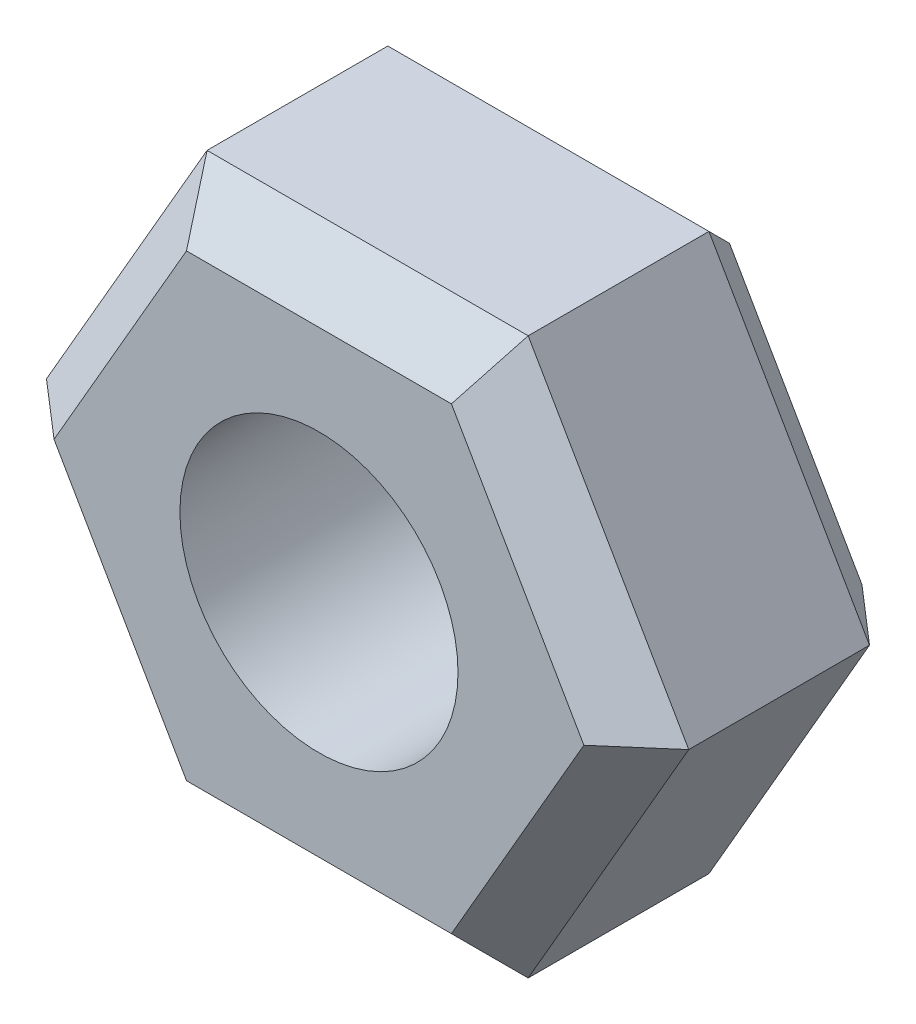
ISO-10303-21;
HEADER;
FILE_DESCRIPTION(('STEP AP214'),'2;1');
FILE_NAME('part.step','',(''),(''),'','','');
FILE_SCHEMA(('AUTOMOTIVE_DESIGN { 1 0 10303 214 1 1 1 1 }'));
ENDSEC;
DATA;
#1=APPLICATION_CONTEXT('core data for automotive mechanical design processes');
#2=APPLICATION_PROTOCOL_DEFINITION('international standard','automotive_design',2000,#1);
#3=PRODUCT_CONTEXT('',#1,'mechanical');
#4=PRODUCT('Part','Part','',(#3));
#5=PRODUCT_RELATED_PRODUCT_CATEGORY('part','',(#4));
#6=PRODUCT_DEFINITION_FORMATION('','',#4);
#7=PRODUCT_DEFINITION_CONTEXT('part definition',#1,'design');
#8=PRODUCT_DEFINITION('design','',#6,#7);
#9=PRODUCT_DEFINITION_SHAPE('','',#8);
#10=(LENGTH_UNIT() NAMED_UNIT(*) SI_UNIT(.MILLI.,.METRE.));
#11=(NAMED_UNIT(*) PLANE_ANGLE_UNIT() SI_UNIT($,.RADIAN.));
#12=(NAMED_UNIT(*) SI_UNIT($,.STERADIAN.) SOLID_ANGLE_UNIT());
#13=UNCERTAINTY_MEASURE_WITH_UNIT(LENGTH_MEASURE(1.E-05),#10,'distance_accuracy_value','');
#14=(GEOMETRIC_REPRESENTATION_CONTEXT(3) GLOBAL_UNCERTAINTY_ASSIGNED_CONTEXT((#13)) GLOBAL_UNIT_ASSIGNED_CONTEXT((#10,
#11,#12)) REPRESENTATION_CONTEXT('',''));
#15=CARTESIAN_POINT('',(0.,0.,0.));
#16=DIRECTION('',(0.,0.,1.));
#17=DIRECTION('',(1.,0.,0.));
#18=AXIS2_PLACEMENT_3D('',#15,#16,#17);
#19=CARTESIAN_POINT('',(0.,0.,2.));
#20=DIRECTION('',(0.,0.,1.));
#21=DIRECTION('',(1.,0.,0.));
#22=AXIS2_PLACEMENT_3D('',#19,#20,#21);
#23=PLANE('',#22);
#24=DIRECTION('',(0.5,0.866025403784439,0.));
#25=VECTOR('',#24,1.);
#26=CARTESIAN_POINT('',(2.00629218543395,0.175000000000002,2.));
#27=LINE('',#26,#25);
#28=CARTESIAN_POINT('',(0.952627944162882,-1.65,2.));
#29=VERTEX_POINT('',#28);
#30=CARTESIAN_POINT('',(1.90525588832576,0.,2.));
#31=VERTEX_POINT('',#30);
#32=EDGE_CURVE('E45',#29,#31,#27,.T.);
#33=ORIENTED_EDGE('',*,*,#32,.T.);
#34=DIRECTION('',(-0.5,0.866025403784439,0.));
#35=VECTOR('',#34,1.);
#36=CARTESIAN_POINT('',(0.851591647054698,1.825,2.));
#37=LINE('',#36,#35);
#38=CARTESIAN_POINT('',(0.952627944162882,1.65,2.));
#39=VERTEX_POINT('',#38);
#40=EDGE_CURVE('E11',#31,#39,#37,.T.);
#41=ORIENTED_EDGE('',*,*,#40,.T.);
#42=DIRECTION('',(-1.,0.,0.));
#43=VECTOR('',#42,1.);
#44=CARTESIAN_POINT('',(-1.15470053837925,1.65,2.));
#45=LINE('',#44,#43);
#46=CARTESIAN_POINT('',(-0.952627944162882,1.65,2.));
#47=VERTEX_POINT('',#46);
#48=EDGE_CURVE('E198',#39,#47,#45,.T.);
#49=ORIENTED_EDGE('',*,*,#48,.T.);
#50=DIRECTION('',(-0.5,-0.866025403784439,0.));
#51=VECTOR('',#50,1.);
#52=CARTESIAN_POINT('',(-2.00629218543395,-0.175000000000001,2.));
#53=LINE('',#52,#51);
#54=CARTESIAN_POINT('',(-1.90525588832576,0.,2.));
#55=VERTEX_POINT('',#54);
#56=EDGE_CURVE('E200',#47,#55,#53,.T.);
#57=ORIENTED_EDGE('',*,*,#56,.T.);
#58=DIRECTION('',(0.5,-0.866025403784439,0.));
#59=VECTOR('',#58,1.);
#60=CARTESIAN_POINT('',(-0.851591647054698,-1.825,2.));
#61=LINE('',#60,#59);
#62=CARTESIAN_POINT('',(-0.952627944162882,-1.65,2.));
#63=VERTEX_POINT('',#62);
#64=EDGE_CURVE('E202',#55,#63,#61,.T.);
#65=ORIENTED_EDGE('',*,*,#64,.T.);
#66=DIRECTION('',(1.,0.,0.));
#67=VECTOR('',#66,1.);
#68=CARTESIAN_POINT('',(1.15470053837925,-1.65,2.));
#69=LINE('',#68,#67);
#70=EDGE_CURVE('E56',#63,#29,#69,.T.);
#71=ORIENTED_EDGE('',*,*,#70,.T.);
#72=EDGE_LOOP('',(#33,#41,#49,#57,#65,#71));
#73=FACE_BOUND('',#72,.T.);
#74=CARTESIAN_POINT('',(0.,0.,2.));
#75=DIRECTION('',(0.,0.,1.));
#76=DIRECTION('',(1.,0.,0.));
#77=AXIS2_PLACEMENT_3D('',#74,#75,#76);
#78=CIRCLE('',#77,1.);
#79=CARTESIAN_POINT('',(1.,0.,2.));
#80=VERTEX_POINT('',#79);
#81=EDGE_CURVE('E252',#80,#80,#78,.T.);
#82=ORIENTED_EDGE('',*,*,#81,.F.);
#83=EDGE_LOOP('',(#82));
#84=FACE_BOUND('',#83,.T.);
#85=ADVANCED_FACE('F36',(#73,#84),#23,.T.);
#86=CARTESIAN_POINT('',(0.,0.,0.));
#87=DIRECTION('',(0.,0.,1.));
#88=DIRECTION('',(1.,0.,0.));
#89=AXIS2_PLACEMENT_3D('',#86,#87,#88);
#90=PLANE('',#89);
#91=DIRECTION('',(0.5,-0.866025403784439,0.));
#92=VECTOR('',#91,1.);
#93=CARTESIAN_POINT('',(1.42894191624432,0.825,0.));
#94=LINE('',#93,#92);
#95=CARTESIAN_POINT('',(0.952627944162882,1.65,0.));
#96=VERTEX_POINT('',#95);
#97=CARTESIAN_POINT('',(1.90525588832576,0.,0.));
#98=VERTEX_POINT('',#97);
#99=EDGE_CURVE('E169',#96,#98,#94,.T.);
#100=ORIENTED_EDGE('',*,*,#99,.T.);
#101=DIRECTION('',(-0.5,-0.866025403784439,0.));
#102=VECTOR('',#101,1.);
#103=CARTESIAN_POINT('',(1.42894191624432,-0.824999999999999,0.));
#104=LINE('',#103,#102);
#105=CARTESIAN_POINT('',(0.952627944162882,-1.65,0.));
#106=VERTEX_POINT('',#105);
#107=EDGE_CURVE('E179',#98,#106,#104,.T.);
#108=ORIENTED_EDGE('',*,*,#107,.T.);
#109=DIRECTION('',(-1.,0.,0.));
#110=VECTOR('',#109,1.);
#111=CARTESIAN_POINT('',(0.,-1.65,0.));
#112=LINE('',#111,#110);
#113=CARTESIAN_POINT('',(-0.952627944162882,-1.65,0.));
#114=VERTEX_POINT('',#113);
#115=EDGE_CURVE('E177',#106,#114,#112,.T.);
#116=ORIENTED_EDGE('',*,*,#115,.T.);
#117=DIRECTION('',(-0.5,0.866025403784439,0.));
#118=VECTOR('',#117,1.);
#119=CARTESIAN_POINT('',(-1.42894191624432,-0.824999999999999,0.));
#120=LINE('',#119,#118);
#121=CARTESIAN_POINT('',(-1.90525588832576,0.,0.));
#122=VERTEX_POINT('',#121);
#123=EDGE_CURVE('E175',#114,#122,#120,.T.);
#124=ORIENTED_EDGE('',*,*,#123,.T.);
#125=DIRECTION('',(0.5,0.866025403784439,0.));
#126=VECTOR('',#125,1.);
#127=CARTESIAN_POINT('',(-1.42894191624432,0.824999999999999,0.));
#128=LINE('',#127,#126);
#129=CARTESIAN_POINT('',(-0.952627944162882,1.65,0.));
#130=VERTEX_POINT('',#129);
#131=EDGE_CURVE('E173',#122,#130,#128,.T.);
#132=ORIENTED_EDGE('',*,*,#131,.T.);
#133=DIRECTION('',(1.,0.,0.));
#134=VECTOR('',#133,1.);
#135=CARTESIAN_POINT('',(0.,1.65,0.));
#136=LINE('',#135,#134);
#137=EDGE_CURVE('E171',#130,#96,#136,.T.);
#138=ORIENTED_EDGE('',*,*,#137,.T.);
#139=EDGE_LOOP('',(#100,#108,#116,#124,#132,#138));
#140=FACE_BOUND('',#139,.T.);
#141=CARTESIAN_POINT('',(0.,0.,0.));
#142=DIRECTION('',(0.,0.,1.));
#143=DIRECTION('',(1.,0.,0.));
#144=AXIS2_PLACEMENT_3D('',#141,#142,#143);
#145=CIRCLE('',#144,1.);
#146=CARTESIAN_POINT('',(1.,0.,0.));
#147=VERTEX_POINT('',#146);
#148=EDGE_CURVE('E222',#147,#147,#145,.T.);
#149=ORIENTED_EDGE('',*,*,#148,.T.);
#150=EDGE_LOOP('',(#149));
#151=FACE_BOUND('',#150,.T.);
#152=ADVANCED_FACE('F260',(#140,#151),#90,.F.);
#153=CARTESIAN_POINT('',(-2.3094010767585,0.,2.));
#154=DIRECTION('',(0.866025403784439,0.5,0.));
#155=DIRECTION('',(-0.5,0.866025403784439,0.));
#156=AXIS2_PLACEMENT_3D('',#153,#154,#155);
#157=PLANE('',#156);
#158=DIRECTION('',(0.,0.,-1.));
#159=VECTOR('',#158,1.);
#160=CARTESIAN_POINT('',(-2.3094010767585,0.,2.));
#161=LINE('',#160,#159);
#162=CARTESIAN_POINT('',(-2.3094010767585,0.,1.65));
#163=VERTEX_POINT('',#162);
#164=CARTESIAN_POINT('',(-2.3094010767585,0.,0.35));
#165=VERTEX_POINT('',#164);
#166=EDGE_CURVE('E245',#163,#165,#161,.T.);
#167=ORIENTED_EDGE('',*,*,#166,.T.);
#168=DIRECTION('',(0.5,-0.866025403784439,0.));
#169=VECTOR('',#168,1.);
#170=CARTESIAN_POINT('',(-2.3094010767585,0.,0.35));
#171=LINE('',#170,#169);
#172=CARTESIAN_POINT('',(-1.15470053837925,-2.,0.35));
#173=VERTEX_POINT('',#172);
#174=EDGE_CURVE('E188',#165,#173,#171,.T.);
#175=ORIENTED_EDGE('',*,*,#174,.T.);
#176=DIRECTION('',(0.,0.,-1.));
#177=VECTOR('',#176,1.);
#178=CARTESIAN_POINT('',(-1.15470053837925,-2.,2.));
#179=LINE('',#178,#177);
#180=CARTESIAN_POINT('',(-1.15470053837925,-2.,1.65));
#181=VERTEX_POINT('',#180);
#182=EDGE_CURVE('E144',#181,#173,#179,.T.);
#183=ORIENTED_EDGE('',*,*,#182,.F.);
#184=DIRECTION('',(-0.5,0.866025403784439,0.));
#185=VECTOR('',#184,1.);
#186=CARTESIAN_POINT('',(-2.3094010767585,0.,1.65));
#187=LINE('',#186,#185);
#188=EDGE_CURVE('E186',#181,#163,#187,.T.);
#189=ORIENTED_EDGE('',*,*,#188,.T.);
#190=EDGE_LOOP('',(#167,#175,#183,#189));
#191=FACE_BOUND('',#190,.T.);
#192=ADVANCED_FACE('F244',(#191),#157,.F.);
#193=CARTESIAN_POINT('',(-1.15470053837925,-2.,2.));
#194=DIRECTION('',(0.,1.,0.));
#195=DIRECTION('',(0.,0.,1.));
#196=AXIS2_PLACEMENT_3D('',#193,#194,#195);
#197=PLANE('',#196);
#198=ORIENTED_EDGE('',*,*,#182,.T.);
#199=DIRECTION('',(1.,0.,0.));
#200=VECTOR('',#199,1.);
#201=CARTESIAN_POINT('',(-1.15470053837925,-2.,0.35));
#202=LINE('',#201,#200);
#203=CARTESIAN_POINT('',(1.15470053837925,-2.,0.35));
#204=VERTEX_POINT('',#203);
#205=EDGE_CURVE('E184',#173,#204,#202,.T.);
#206=ORIENTED_EDGE('',*,*,#205,.T.);
#207=DIRECTION('',(0.,0.,-1.));
#208=VECTOR('',#207,1.);
#209=CARTESIAN_POINT('',(1.15470053837925,-2.,2.));
#210=LINE('',#209,#208);
#211=CARTESIAN_POINT('',(1.15470053837925,-2.,1.65));
#212=VERTEX_POINT('',#211);
#213=EDGE_CURVE('E159',#212,#204,#210,.T.);
#214=ORIENTED_EDGE('',*,*,#213,.F.);
#215=DIRECTION('',(-1.,0.,0.));
#216=VECTOR('',#215,1.);
#217=CARTESIAN_POINT('',(-1.15470053837925,-2.,1.65));
#218=LINE('',#217,#216);
#219=EDGE_CURVE('E182',#212,#181,#218,.T.);
#220=ORIENTED_EDGE('',*,*,#219,.T.);
#221=EDGE_LOOP('',(#198,#206,#214,#220));
#222=FACE_BOUND('',#221,.T.);
#223=ADVANCED_FACE('F292',(#222),#197,.F.);
#224=CARTESIAN_POINT('',(1.15470053837925,-2.,2.));
#225=DIRECTION('',(-0.866025403784439,0.5,0.));
#226=DIRECTION('',(-0.5,-0.866025403784439,0.));
#227=AXIS2_PLACEMENT_3D('',#224,#225,#226);
#228=PLANE('',#227);
#229=ORIENTED_EDGE('',*,*,#213,.T.);
#230=DIRECTION('',(0.5,0.866025403784439,0.));
#231=VECTOR('',#230,1.);
#232=CARTESIAN_POINT('',(1.15470053837925,-2.,0.35));
#233=LINE('',#232,#231);
#234=CARTESIAN_POINT('',(2.3094010767585,0.,0.35));
#235=VERTEX_POINT('',#234);
#236=EDGE_CURVE('E143',#204,#235,#233,.T.);
#237=ORIENTED_EDGE('',*,*,#236,.T.);
#238=DIRECTION('',(0.,0.,-1.));
#239=VECTOR('',#238,1.);
#240=CARTESIAN_POINT('',(2.3094010767585,0.,2.));
#241=LINE('',#240,#239);
#242=CARTESIAN_POINT('',(2.3094010767585,0.,1.65));
#243=VERTEX_POINT('',#242);
#244=EDGE_CURVE('E150',#243,#235,#241,.T.);
#245=ORIENTED_EDGE('',*,*,#244,.F.);
#246=DIRECTION('',(-0.5,-0.866025403784439,0.));
#247=VECTOR('',#246,1.);
#248=CARTESIAN_POINT('',(1.15470053837925,-2.,1.65));
#249=LINE('',#248,#247);
#250=EDGE_CURVE('E136',#243,#212,#249,.T.);
#251=ORIENTED_EDGE('',*,*,#250,.T.);
#252=EDGE_LOOP('',(#229,#237,#245,#251));
#253=FACE_BOUND('',#252,.T.);
#254=ADVANCED_FACE('F157',(#253),#228,.F.);
#255=CARTESIAN_POINT('',(2.3094010767585,0.,2.));
#256=DIRECTION('',(-0.866025403784439,-0.5,0.));
#257=DIRECTION('',(0.5,-0.866025403784439,0.));
#258=AXIS2_PLACEMENT_3D('',#255,#256,#257);
#259=PLANE('',#258);
#260=ORIENTED_EDGE('',*,*,#244,.T.);
#261=DIRECTION('',(-0.5,0.866025403784439,0.));
#262=VECTOR('',#261,1.);
#263=CARTESIAN_POINT('',(2.3094010767585,0.,0.35));
#264=LINE('',#263,#262);
#265=CARTESIAN_POINT('',(1.15470053837925,2.,0.35));
#266=VERTEX_POINT('',#265);
#267=EDGE_CURVE('E153',#235,#266,#264,.T.);
#268=ORIENTED_EDGE('',*,*,#267,.T.);
#269=DIRECTION('',(0.,0.,-1.));
#270=VECTOR('',#269,1.);
#271=CARTESIAN_POINT('',(1.15470053837925,2.,2.));
#272=LINE('',#271,#270);
#273=CARTESIAN_POINT('',(1.15470053837925,2.,1.65));
#274=VERTEX_POINT('',#273);
#275=EDGE_CURVE('E152',#274,#266,#272,.T.);
#276=ORIENTED_EDGE('',*,*,#275,.F.);
#277=DIRECTION('',(0.5,-0.866025403784439,0.));
#278=VECTOR('',#277,1.);
#279=CARTESIAN_POINT('',(2.3094010767585,0.,1.65));
#280=LINE('',#279,#278);
#281=EDGE_CURVE('E129',#274,#243,#280,.T.);
#282=ORIENTED_EDGE('',*,*,#281,.T.);
#283=EDGE_LOOP('',(#260,#268,#276,#282));
#284=FACE_BOUND('',#283,.T.);
#285=ADVANCED_FACE('F149',(#284),#259,.F.);
#286=CARTESIAN_POINT('',(1.15470053837925,2.,2.));
#287=DIRECTION('',(0.,-1.,0.));
#288=DIRECTION('',(1.,0.,0.));
#289=AXIS2_PLACEMENT_3D('',#286,#287,#288);
#290=PLANE('',#289);
#291=ORIENTED_EDGE('',*,*,#275,.T.);
#292=DIRECTION('',(-1.,0.,0.));
#293=VECTOR('',#292,1.);
#294=CARTESIAN_POINT('',(1.15470053837925,2.,0.35));
#295=LINE('',#294,#293);
#296=CARTESIAN_POINT('',(-1.15470053837925,2.,0.35));
#297=VERTEX_POINT('',#296);
#298=EDGE_CURVE('E154',#266,#297,#295,.T.);
#299=ORIENTED_EDGE('',*,*,#298,.T.);
#300=DIRECTION('',(0.,0.,-1.));
#301=VECTOR('',#300,1.);
#302=CARTESIAN_POINT('',(-1.15470053837925,2.,2.));
#303=LINE('',#302,#301);
#304=CARTESIAN_POINT('',(-1.15470053837925,2.,1.65));
#305=VERTEX_POINT('',#304);
#306=EDGE_CURVE('E162',#305,#297,#303,.T.);
#307=ORIENTED_EDGE('',*,*,#306,.F.);
#308=DIRECTION('',(1.,0.,0.));
#309=VECTOR('',#308,1.);
#310=CARTESIAN_POINT('',(1.15470053837925,2.,1.65));
#311=LINE('',#310,#309);
#312=EDGE_CURVE('E194',#305,#274,#311,.T.);
#313=ORIENTED_EDGE('',*,*,#312,.T.);
#314=EDGE_LOOP('',(#291,#299,#307,#313));
#315=FACE_BOUND('',#314,.T.);
#316=ADVANCED_FACE('F274',(#315),#290,.F.);
#317=CARTESIAN_POINT('',(-1.15470053837925,2.,2.));
#318=DIRECTION('',(0.866025403784439,-0.5,0.));
#319=DIRECTION('',(0.5,0.866025403784439,0.));
#320=AXIS2_PLACEMENT_3D('',#317,#318,#319);
#321=PLANE('',#320);
#322=ORIENTED_EDGE('',*,*,#306,.T.);
#323=DIRECTION('',(-0.5,-0.866025403784439,0.));
#324=VECTOR('',#323,1.);
#325=CARTESIAN_POINT('',(-1.15470053837925,2.,0.35));
#326=LINE('',#325,#324);
#327=EDGE_CURVE('E192',#297,#165,#326,.T.);
#328=ORIENTED_EDGE('',*,*,#327,.T.);
#329=ORIENTED_EDGE('',*,*,#166,.F.);
#330=DIRECTION('',(0.5,0.866025403784439,0.));
#331=VECTOR('',#330,1.);
#332=CARTESIAN_POINT('',(-1.15470053837925,2.,1.65));
#333=LINE('',#332,#331);
#334=EDGE_CURVE('E190',#163,#305,#333,.T.);
#335=ORIENTED_EDGE('',*,*,#334,.T.);
#336=EDGE_LOOP('',(#322,#328,#329,#335));
#337=FACE_BOUND('',#336,.T.);
#338=ADVANCED_FACE('F249',(#337),#321,.F.);
#339=CARTESIAN_POINT('',(0.,0.,2.));
#340=DIRECTION('',(0.,0.,-1.));
#341=DIRECTION('',(-1.,0.,0.));
#342=AXIS2_PLACEMENT_3D('',#339,#340,#341);
#343=CYLINDRICAL_SURFACE('',#342,1.);
#344=ORIENTED_EDGE('',*,*,#81,.T.);
#345=EDGE_LOOP('',(#344));
#346=FACE_BOUND('',#345,.T.);
#347=ORIENTED_EDGE('',*,*,#148,.F.);
#348=EDGE_LOOP('',(#347));
#349=FACE_BOUND('',#348,.T.);
#350=ADVANCED_FACE('F262',(#346,#349),#343,.F.);
#351=CARTESIAN_POINT('',(-1.15470053837925,2.,0.35));
#352=DIRECTION('',(0.612372435695793,-0.353553390593273,0.707106781186549));
#353=DIRECTION('',(-0.5,-0.866025403784439,0.));
#354=AXIS2_PLACEMENT_3D('',#351,#352,#353);
#355=PLANE('',#354);
#356=DIRECTION('',(-0.377964473009228,0.654653670707979,0.654653670707975));
#357=VECTOR('',#356,1.);
#358=CARTESIAN_POINT('',(-0.824786098842322,1.42857142857143,-0.221428571428571));
#359=LINE('',#358,#357);
#360=EDGE_CURVE('E216',#130,#297,#359,.T.);
#361=ORIENTED_EDGE('',*,*,#360,.F.);
#362=ORIENTED_EDGE('',*,*,#131,.F.);
#363=DIRECTION('',(-0.755928946018456,0.,0.654653670707975));
#364=VECTOR('',#363,1.);
#365=CARTESIAN_POINT('',(-1.64957219768464,0.,-0.221428571428572));
#366=LINE('',#365,#364);
#367=EDGE_CURVE('E219',#165,#122,#366,.F.);
#368=ORIENTED_EDGE('',*,*,#367,.F.);
#369=ORIENTED_EDGE('',*,*,#327,.F.);
#370=EDGE_LOOP('',(#361,#362,#368,#369));
#371=FACE_BOUND('',#370,.T.);
#372=ADVANCED_FACE('F264',(#371),#355,.F.);
#373=CARTESIAN_POINT('',(-2.3094010767585,0.,0.35));
#374=DIRECTION('',(0.612372435695793,0.353553390593273,0.70710678118655));
#375=DIRECTION('',(0.5,-0.866025403784439,0.));
#376=AXIS2_PLACEMENT_3D('',#373,#374,#375);
#377=PLANE('',#376);
#378=ORIENTED_EDGE('',*,*,#367,.T.);
#379=ORIENTED_EDGE('',*,*,#123,.F.);
#380=DIRECTION('',(-0.377964473009228,-0.654653670707979,0.654653670707975));
#381=VECTOR('',#380,1.);
#382=CARTESIAN_POINT('',(-0.824786098842321,-1.42857142857143,-0.221428571428571));
#383=LINE('',#382,#381);
#384=EDGE_CURVE('E213',#173,#114,#383,.F.);
#385=ORIENTED_EDGE('',*,*,#384,.F.);
#386=ORIENTED_EDGE('',*,*,#174,.F.);
#387=EDGE_LOOP('',(#378,#379,#385,#386));
#388=FACE_BOUND('',#387,.T.);
#389=ADVANCED_FACE('F271',(#388),#377,.F.);
#390=CARTESIAN_POINT('',(1.15470053837925,2.,0.35));
#391=DIRECTION('',(0.,-0.707106781186545,0.707106781186549));
#392=DIRECTION('',(-1.,0.,0.));
#393=AXIS2_PLACEMENT_3D('',#390,#391,#392);
#394=PLANE('',#393);
#395=ORIENTED_EDGE('',*,*,#360,.T.);
#396=ORIENTED_EDGE('',*,*,#298,.F.);
#397=DIRECTION('',(0.377964473009228,0.654653670707979,0.654653670707975));
#398=VECTOR('',#397,1.);
#399=CARTESIAN_POINT('',(0.824786098842322,1.42857142857143,-0.221428571428571));
#400=LINE('',#399,#398);
#401=EDGE_CURVE('E210',#96,#266,#400,.T.);
#402=ORIENTED_EDGE('',*,*,#401,.F.);
#403=ORIENTED_EDGE('',*,*,#137,.F.);
#404=EDGE_LOOP('',(#395,#396,#402,#403));
#405=FACE_BOUND('',#404,.T.);
#406=ADVANCED_FACE('F309',(#405),#394,.F.);
#407=CARTESIAN_POINT('',(-1.15470053837925,-2.,0.35));
#408=DIRECTION('',(0.,0.707106781186545,0.707106781186549));
#409=DIRECTION('',(1.,0.,0.));
#410=AXIS2_PLACEMENT_3D('',#407,#408,#409);
#411=PLANE('',#410);
#412=ORIENTED_EDGE('',*,*,#384,.T.);
#413=ORIENTED_EDGE('',*,*,#115,.F.);
#414=DIRECTION('',(0.377964473009228,-0.654653670707979,0.654653670707975));
#415=VECTOR('',#414,1.);
#416=CARTESIAN_POINT('',(0.824786098842322,-1.42857142857143,-0.221428571428571));
#417=LINE('',#416,#415);
#418=EDGE_CURVE('E208',#204,#106,#417,.F.);
#419=ORIENTED_EDGE('',*,*,#418,.F.);
#420=ORIENTED_EDGE('',*,*,#205,.F.);
#421=EDGE_LOOP('',(#412,#413,#419,#420));
#422=FACE_BOUND('',#421,.T.);
#423=ADVANCED_FACE('F305',(#422),#411,.F.);
#424=CARTESIAN_POINT('',(2.3094010767585,0.,0.35));
#425=DIRECTION('',(-0.612372435695793,-0.353553390593273,0.707106781186549));
#426=DIRECTION('',(-0.5,0.866025403784439,0.));
#427=AXIS2_PLACEMENT_3D('',#424,#425,#426);
#428=PLANE('',#427);
#429=ORIENTED_EDGE('',*,*,#401,.T.);
#430=ORIENTED_EDGE('',*,*,#267,.F.);
#431=DIRECTION('',(-0.755928946018456,0.,-0.654653670707975));
#432=VECTOR('',#431,1.);
#433=CARTESIAN_POINT('',(2.3094010767585,0.,0.35));
#434=LINE('',#433,#432);
#435=EDGE_CURVE('E206',#98,#235,#434,.F.);
#436=ORIENTED_EDGE('',*,*,#435,.F.);
#437=ORIENTED_EDGE('',*,*,#99,.F.);
#438=EDGE_LOOP('',(#429,#430,#436,#437));
#439=FACE_BOUND('',#438,.T.);
#440=ADVANCED_FACE('F301',(#439),#428,.F.);
#441=CARTESIAN_POINT('',(1.15470053837925,-2.,0.35));
#442=DIRECTION('',(-0.612372435695793,0.353553390593273,0.707106781186549));
#443=DIRECTION('',(0.5,0.866025403784439,0.));
#444=AXIS2_PLACEMENT_3D('',#441,#442,#443);
#445=PLANE('',#444);
#446=ORIENTED_EDGE('',*,*,#418,.T.);
#447=ORIENTED_EDGE('',*,*,#107,.F.);
#448=ORIENTED_EDGE('',*,*,#435,.T.);
#449=ORIENTED_EDGE('',*,*,#236,.F.);
#450=EDGE_LOOP('',(#446,#447,#448,#449));
#451=FACE_BOUND('',#450,.T.);
#452=ADVANCED_FACE('F298',(#451),#445,.F.);
#453=CARTESIAN_POINT('',(-1.42894191624432,-0.825,2.));
#454=DIRECTION('',(-0.612372435695796,-0.353553390593275,0.707106781186546));
#455=DIRECTION('',(-0.5,0.866025403784439,0.));
#456=AXIS2_PLACEMENT_3D('',#453,#454,#455);
#457=PLANE('',#456);
#458=DIRECTION('',(0.755928946018453,0.,0.654653670707979));
#459=VECTOR('',#458,1.);
#460=CARTESIAN_POINT('',(-1.6330764757078,0.,2.23571428571429));
#461=LINE('',#460,#459);
#462=EDGE_CURVE('E226',#163,#55,#461,.T.);
#463=ORIENTED_EDGE('',*,*,#462,.F.);
#464=ORIENTED_EDGE('',*,*,#188,.F.);
#465=DIRECTION('',(0.377964473009227,0.654653670707976,0.654653670707979));
#466=VECTOR('',#465,1.);
#467=CARTESIAN_POINT('',(-0.8165382378539,-1.41428571428572,2.23571428571429));
#468=LINE('',#467,#466);
#469=EDGE_CURVE('E40',#63,#181,#468,.F.);
#470=ORIENTED_EDGE('',*,*,#469,.F.);
#471=ORIENTED_EDGE('',*,*,#64,.F.);
#472=EDGE_LOOP('',(#463,#464,#470,#471));
#473=FACE_BOUND('',#472,.T.);
#474=ADVANCED_FACE('F38',(#473),#457,.T.);
#475=CARTESIAN_POINT('',(0.,-1.65,2.));
#476=DIRECTION('',(0.,-0.707106781186549,0.707106781186546));
#477=DIRECTION('',(-1.,0.,0.));
#478=AXIS2_PLACEMENT_3D('',#475,#476,#477);
#479=PLANE('',#478);
#480=ORIENTED_EDGE('',*,*,#469,.T.);
#481=ORIENTED_EDGE('',*,*,#219,.F.);
#482=DIRECTION('',(-0.377964473009227,0.654653670707976,0.654653670707979));
#483=VECTOR('',#482,1.);
#484=CARTESIAN_POINT('',(0.816538237853899,-1.41428571428572,2.23571428571429));
#485=LINE('',#484,#483);
#486=EDGE_CURVE('E138',#29,#212,#485,.F.);
#487=ORIENTED_EDGE('',*,*,#486,.F.);
#488=ORIENTED_EDGE('',*,*,#70,.F.);
#489=EDGE_LOOP('',(#480,#481,#487,#488));
#490=FACE_BOUND('',#489,.T.);
#491=ADVANCED_FACE('F236',(#490),#479,.T.);
#492=CARTESIAN_POINT('',(-1.42894191624432,0.824999999999999,2.));
#493=DIRECTION('',(-0.612372435695796,0.353553390593274,0.707106781186546));
#494=DIRECTION('',(0.5,0.866025403784439,0.));
#495=AXIS2_PLACEMENT_3D('',#492,#493,#494);
#496=PLANE('',#495);
#497=ORIENTED_EDGE('',*,*,#462,.T.);
#498=ORIENTED_EDGE('',*,*,#56,.F.);
#499=DIRECTION('',(0.377964473009227,-0.654653670707975,0.654653670707979));
#500=VECTOR('',#499,1.);
#501=CARTESIAN_POINT('',(-0.8165382378539,1.41428571428571,2.23571428571429));
#502=LINE('',#501,#500);
#503=EDGE_CURVE('E132',#305,#47,#502,.T.);
#504=ORIENTED_EDGE('',*,*,#503,.F.);
#505=ORIENTED_EDGE('',*,*,#334,.F.);
#506=EDGE_LOOP('',(#497,#498,#504,#505));
#507=FACE_BOUND('',#506,.T.);
#508=ADVANCED_FACE('F325',(#507),#496,.T.);
#509=CARTESIAN_POINT('',(1.42894191624432,-0.824999999999999,2.));
#510=DIRECTION('',(0.612372435695796,-0.353553390593274,0.707106781186546));
#511=DIRECTION('',(-0.5,-0.866025403784439,0.));
#512=AXIS2_PLACEMENT_3D('',#509,#510,#511);
#513=PLANE('',#512);
#514=ORIENTED_EDGE('',*,*,#486,.T.);
#515=ORIENTED_EDGE('',*,*,#250,.F.);
#516=DIRECTION('',(-0.755928946018453,0.,0.654653670707979));
#517=VECTOR('',#516,1.);
#518=CARTESIAN_POINT('',(1.6330764757078,0.,2.23571428571429));
#519=LINE('',#518,#517);
#520=EDGE_CURVE('E125',#31,#243,#519,.F.);
#521=ORIENTED_EDGE('',*,*,#520,.F.);
#522=ORIENTED_EDGE('',*,*,#32,.F.);
#523=EDGE_LOOP('',(#514,#515,#521,#522));
#524=FACE_BOUND('',#523,.T.);
#525=ADVANCED_FACE('F137',(#524),#513,.T.);
#526=CARTESIAN_POINT('',(0.,1.65,2.));
#527=DIRECTION('',(0.,0.707106781186549,0.707106781186546));
#528=DIRECTION('',(1.,0.,0.));
#529=AXIS2_PLACEMENT_3D('',#526,#527,#528);
#530=PLANE('',#529);
#531=ORIENTED_EDGE('',*,*,#503,.T.);
#532=ORIENTED_EDGE('',*,*,#48,.F.);
#533=DIRECTION('',(0.377964473009226,0.654653670707976,-0.654653670707979));
#534=VECTOR('',#533,1.);
#535=CARTESIAN_POINT('',(0.8165382378539,1.41428571428572,2.23571428571429));
#536=LINE('',#535,#534);
#537=EDGE_CURVE('E133',#274,#39,#536,.F.);
#538=ORIENTED_EDGE('',*,*,#537,.F.);
#539=ORIENTED_EDGE('',*,*,#312,.F.);
#540=EDGE_LOOP('',(#531,#532,#538,#539));
#541=FACE_BOUND('',#540,.T.);
#542=ADVANCED_FACE('F319',(#541),#530,.T.);
#543=CARTESIAN_POINT('',(1.42894191624432,0.825,2.));
#544=DIRECTION('',(0.612372435695796,0.353553390593275,0.707106781186546));
#545=DIRECTION('',(0.5,-0.866025403784439,0.));
#546=AXIS2_PLACEMENT_3D('',#543,#544,#545);
#547=PLANE('',#546);
#548=ORIENTED_EDGE('',*,*,#520,.T.);
#549=ORIENTED_EDGE('',*,*,#281,.F.);
#550=ORIENTED_EDGE('',*,*,#537,.T.);
#551=ORIENTED_EDGE('',*,*,#40,.F.);
#552=EDGE_LOOP('',(#548,#549,#550,#551));
#553=FACE_BOUND('',#552,.T.);
#554=ADVANCED_FACE('F127',(#553),#547,.T.);
#555=CLOSED_SHELL('',(#85,#152,#192,#223,#254,#285,#316,#338,#350,#372,#389,#406,#423,#440,#452,
#474,#491,#508,#525,#542,#554));
#556=MANIFOLD_SOLID_BREP('B2',#555);
#557=ADVANCED_BREP_SHAPE_REPRESENTATION('',(#18,#556),#14);
#558=SHAPE_DEFINITION_REPRESENTATION(#9,#557);
ENDSEC;
END-ISO-10303-21;
